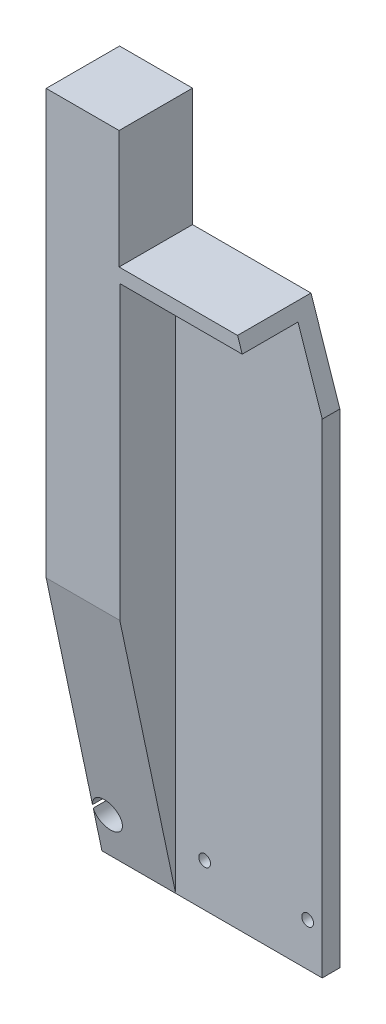
ISO-10303-21;
HEADER;
FILE_DESCRIPTION(('STEP AP214'),'2;1');
FILE_NAME('part.step','',(''),(''),'','','');
FILE_SCHEMA(('AUTOMOTIVE_DESIGN { 1 0 10303 214 1 1 1 1 }'));
ENDSEC;
DATA;
#1=APPLICATION_CONTEXT('core data for automotive mechanical design processes');
#2=APPLICATION_PROTOCOL_DEFINITION('international standard','automotive_design',2000,#1);
#3=PRODUCT_CONTEXT('',#1,'mechanical');
#4=PRODUCT('Part','Part','',(#3));
#5=PRODUCT_RELATED_PRODUCT_CATEGORY('part','',(#4));
#6=PRODUCT_DEFINITION_FORMATION('','',#4);
#7=PRODUCT_DEFINITION_CONTEXT('part definition',#1,'design');
#8=PRODUCT_DEFINITION('design','',#6,#7);
#9=PRODUCT_DEFINITION_SHAPE('','',#8);
#10=(LENGTH_UNIT() NAMED_UNIT(*) SI_UNIT(.MILLI.,.METRE.));
#11=(NAMED_UNIT(*) PLANE_ANGLE_UNIT() SI_UNIT($,.RADIAN.));
#12=(NAMED_UNIT(*) SI_UNIT($,.STERADIAN.) SOLID_ANGLE_UNIT());
#13=UNCERTAINTY_MEASURE_WITH_UNIT(LENGTH_MEASURE(1.E-05),#10,'distance_accuracy_value','');
#14=(GEOMETRIC_REPRESENTATION_CONTEXT(3) GLOBAL_UNCERTAINTY_ASSIGNED_CONTEXT((#13)) GLOBAL_UNIT_ASSIGNED_CONTEXT((#10,
#11,#12)) REPRESENTATION_CONTEXT('',''));
#15=CARTESIAN_POINT('',(0.,0.,0.));
#16=DIRECTION('',(0.,0.,1.));
#17=DIRECTION('',(1.,0.,0.));
#18=AXIS2_PLACEMENT_3D('',#15,#16,#17);
#19=CARTESIAN_POINT('',(0.,0.,6.));
#20=DIRECTION('',(0.,0.,1.));
#21=DIRECTION('',(1.,0.,0.));
#22=AXIS2_PLACEMENT_3D('',#19,#20,#21);
#23=PLANE('',#22);
#24=CARTESIAN_POINT('',(-2.54199999999999,-102.503947691992,6.));
#25=DIRECTION('',(0.,0.,1.));
#26=DIRECTION('',(1.,0.,0.));
#27=AXIS2_PLACEMENT_3D('',#24,#25,#26);
#28=CIRCLE('',#27,2.);
#29=CARTESIAN_POINT('',(-0.541999999999991,-102.503947691992,6.));
#30=VERTEX_POINT('',#29);
#31=EDGE_CURVE('E162',#30,#30,#28,.T.);
#32=ORIENTED_EDGE('',*,*,#31,.F.);
#33=EDGE_LOOP('',(#32));
#34=FACE_BOUND('',#33,.T.);
#35=CARTESIAN_POINT('',(32.532413900171,-102.503947691992,6.));
#36=DIRECTION('',(0.,0.,1.));
#37=DIRECTION('',(1.,0.,0.));
#38=AXIS2_PLACEMENT_3D('',#35,#36,#37);
#39=CIRCLE('',#38,2.);
#40=CARTESIAN_POINT('',(34.532413900171,-102.503947691992,6.));
#41=VERTEX_POINT('',#40);
#42=EDGE_CURVE('E165',#41,#41,#39,.T.);
#43=ORIENTED_EDGE('',*,*,#42,.F.);
#44=EDGE_LOOP('',(#43));
#45=FACE_BOUND('',#44,.T.);
#46=DIRECTION('',(-1.,0.,0.));
#47=VECTOR('',#46,1.);
#48=CARTESIAN_POINT('',(0.,72.1629607492441,6.));
#49=LINE('',#48,#47);
#50=CARTESIAN_POINT('',(29.262581995732,72.1629607492441,6.));
#51=VERTEX_POINT('',#50);
#52=CARTESIAN_POINT('',(-12.416,72.1629607492441,6.));
#53=VERTEX_POINT('',#52);
#54=EDGE_CURVE('E59',#51,#53,#49,.T.);
#55=ORIENTED_EDGE('',*,*,#54,.T.);
#56=DIRECTION('',(0.,-1.,0.));
#57=VECTOR('',#56,1.);
#58=CARTESIAN_POINT('',(-12.416,0.,6.));
#59=LINE('',#58,#57);
#60=CARTESIAN_POINT('',(-12.416,-117.1625,6.));
#61=VERTEX_POINT('',#60);
#62=EDGE_CURVE('E139',#53,#61,#59,.T.);
#63=ORIENTED_EDGE('',*,*,#62,.T.);
#64=DIRECTION('',(1.,0.,0.));
#65=VECTOR('',#64,1.);
#66=CARTESIAN_POINT('',(0.,-117.1625,6.));
#67=LINE('',#66,#65);
#68=CARTESIAN_POINT('',(37.5,-117.1625,6.));
#69=VERTEX_POINT('',#68);
#70=EDGE_CURVE('E143',#61,#69,#67,.T.);
#71=ORIENTED_EDGE('',*,*,#70,.T.);
#72=DIRECTION('',(0.,1.,0.));
#73=VECTOR('',#72,1.);
#74=CARTESIAN_POINT('',(37.5,0.,6.));
#75=LINE('',#74,#73);
#76=CARTESIAN_POINT('',(37.5,47.6317639070895,6.));
#77=VERTEX_POINT('',#76);
#78=EDGE_CURVE('E151',#69,#77,#75,.T.);
#79=ORIENTED_EDGE('',*,*,#78,.T.);
#80=DIRECTION('',(-0.318326018938917,0.947981300272585,0.));
#81=VECTOR('',#80,1.);
#82=CARTESIAN_POINT('',(48.0737703602293,16.1428626595854,6.));
#83=LINE('',#82,#81);
#84=EDGE_CURVE('E154',#77,#51,#83,.T.);
#85=ORIENTED_EDGE('',*,*,#84,.T.);
#86=EDGE_LOOP('',(#55,#63,#71,#79,#85));
#87=FACE_BOUND('',#86,.T.);
#88=ADVANCED_FACE('F37',(#34,#45,#87),#23,.T.);
#89=CARTESIAN_POINT('',(-37.5,0.,6.));
#90=DIRECTION('',(1.,0.,0.));
#91=DIRECTION('',(0.,0.,-1.));
#92=AXIS2_PLACEMENT_3D('',#89,#90,#91);
#93=PLANE('',#92);
#94=DIRECTION('',(0.,0.,-1.));
#95=VECTOR('',#94,1.);
#96=CARTESIAN_POINT('',(-37.5,-101.931361021652,6.));
#97=LINE('',#96,#95);
#98=CARTESIAN_POINT('',(-37.5,-101.931361021652,9.2154626732068));
#99=VERTEX_POINT('',#98);
#100=CARTESIAN_POINT('',(-37.5,-101.931361021652,0.));
#101=VERTEX_POINT('',#100);
#102=EDGE_CURVE('E45',#99,#101,#97,.T.);
#103=ORIENTED_EDGE('',*,*,#102,.F.);
#104=DIRECTION('',(0.,0.978434284203546,0.206558348887415));
#105=VECTOR('',#104,1.);
#106=CARTESIAN_POINT('',(-37.5,-4.99889640704409,29.6789829807351));
#107=LINE('',#106,#105);
#108=CARTESIAN_POINT('',(-37.5,-27.1625,25.));
#109=VERTEX_POINT('',#108);
#110=EDGE_CURVE('E230',#99,#109,#107,.T.);
#111=ORIENTED_EDGE('',*,*,#110,.T.);
#112=DIRECTION('',(0.,-1.,0.));
#113=VECTOR('',#112,1.);
#114=CARTESIAN_POINT('',(-37.5,0.,25.));
#115=LINE('',#114,#113);
#116=CARTESIAN_POINT('',(-37.5,117.1625,25.));
#117=VERTEX_POINT('',#116);
#118=EDGE_CURVE('E234',#117,#109,#115,.T.);
#119=ORIENTED_EDGE('',*,*,#118,.F.);
#120=DIRECTION('',(0.,0.,-1.));
#121=VECTOR('',#120,1.);
#122=CARTESIAN_POINT('',(-37.5,117.1625,6.));
#123=LINE('',#122,#121);
#124=CARTESIAN_POINT('',(-37.5,117.1625,0.));
#125=VERTEX_POINT('',#124);
#126=EDGE_CURVE('E168',#117,#125,#123,.T.);
#127=ORIENTED_EDGE('',*,*,#126,.T.);
#128=DIRECTION('',(0.,-1.,0.));
#129=VECTOR('',#128,1.);
#130=CARTESIAN_POINT('',(-37.5,0.,0.));
#131=LINE('',#130,#129);
#132=EDGE_CURVE('E145',#125,#101,#131,.T.);
#133=ORIENTED_EDGE('',*,*,#132,.T.);
#134=EDGE_LOOP('',(#103,#111,#119,#127,#133));
#135=FACE_BOUND('',#134,.T.);
#136=ADVANCED_FACE('F39',(#135),#93,.F.);
#137=CARTESIAN_POINT('',(-32.532413900171,-102.499769625378,6.));
#138=DIRECTION('',(0.,0.,-1.));
#139=DIRECTION('',(-1.,0.,0.));
#140=AXIS2_PLACEMENT_3D('',#137,#138,#139);
#141=CYLINDRICAL_SURFACE('',#140,5.00000000000038);
#142=CARTESIAN_POINT('',(-32.532413900171,-102.499769625378,9.09546530130909));
#143=DIRECTION('',(0.,0.206558348887415,-0.978434284203546));
#144=DIRECTION('',(0.,-0.978434284203546,-0.206558348887415));
#145=AXIS2_PLACEMENT_3D('',#142,#143,#144);
#146=ELLIPSE('',#145,5.11020523373261,5.00000000000038);
#147=CARTESIAN_POINT('',(-37.5,-103.068178229104,8.97546792941138));
#148=VERTEX_POINT('',#147);
#149=EDGE_CURVE('E215',#99,#148,#146,.T.);
#150=ORIENTED_EDGE('',*,*,#149,.F.);
#151=ORIENTED_EDGE('',*,*,#102,.T.);
#152=CARTESIAN_POINT('',(-32.532413900171,-102.499769625378,0.));
#153=DIRECTION('',(0.,0.,1.));
#154=DIRECTION('',(1.,0.,0.));
#155=AXIS2_PLACEMENT_3D('',#152,#153,#154);
#156=CIRCLE('',#155,5.00000000000038);
#157=CARTESIAN_POINT('',(-37.5,-103.068178229104,0.));
#158=VERTEX_POINT('',#157);
#159=EDGE_CURVE('E171',#158,#101,#156,.T.);
#160=ORIENTED_EDGE('',*,*,#159,.F.);
#161=DIRECTION('',(0.,0.,-1.));
#162=VECTOR('',#161,1.);
#163=CARTESIAN_POINT('',(-37.5,-103.068178229104,6.));
#164=LINE('',#163,#162);
#165=EDGE_CURVE('E208',#148,#158,#164,.T.);
#166=ORIENTED_EDGE('',*,*,#165,.F.);
#167=EDGE_LOOP('',(#150,#151,#160,#166));
#168=FACE_BOUND('',#167,.T.);
#169=ADVANCED_FACE('F213',(#168),#141,.F.);
#170=CARTESIAN_POINT('',(-37.5,0.,6.));
#171=DIRECTION('',(1.,0.,0.));
#172=DIRECTION('',(0.,0.,-1.));
#173=AXIS2_PLACEMENT_3D('',#170,#171,#172);
#174=PLANE('',#173);
#175=DIRECTION('',(0.,0.,-1.));
#176=VECTOR('',#175,1.);
#177=CARTESIAN_POINT('',(-37.5,-117.1625,6.));
#178=LINE('',#177,#176);
#179=CARTESIAN_POINT('',(-37.5,-117.1625,6.));
#180=VERTEX_POINT('',#179);
#181=CARTESIAN_POINT('',(-37.5,-117.1625,0.));
#182=VERTEX_POINT('',#181);
#183=EDGE_CURVE('E206',#180,#182,#178,.T.);
#184=ORIENTED_EDGE('',*,*,#183,.F.);
#185=DIRECTION('',(0.,0.978434284203546,0.206558348887415));
#186=VECTOR('',#185,1.);
#187=CARTESIAN_POINT('',(-37.5,-4.99889640704409,29.6789829807351));
#188=LINE('',#187,#186);
#189=EDGE_CURVE('E130',#180,#148,#188,.T.);
#190=ORIENTED_EDGE('',*,*,#189,.T.);
#191=ORIENTED_EDGE('',*,*,#165,.T.);
#192=DIRECTION('',(0.,-1.,0.));
#193=VECTOR('',#192,1.);
#194=CARTESIAN_POINT('',(-37.5,0.,0.));
#195=LINE('',#194,#193);
#196=EDGE_CURVE('E174',#158,#182,#195,.T.);
#197=ORIENTED_EDGE('',*,*,#196,.T.);
#198=EDGE_LOOP('',(#184,#190,#191,#197));
#199=FACE_BOUND('',#198,.T.);
#200=ADVANCED_FACE('F228',(#199),#174,.F.);
#201=CARTESIAN_POINT('',(0.,-117.1625,6.));
#202=DIRECTION('',(0.,1.,0.));
#203=DIRECTION('',(0.,0.,1.));
#204=AXIS2_PLACEMENT_3D('',#201,#202,#203);
#205=PLANE('',#204);
#206=ORIENTED_EDGE('',*,*,#70,.F.);
#207=DIRECTION('',(1.,0.,0.));
#208=VECTOR('',#207,1.);
#209=CARTESIAN_POINT('',(-38.416,-117.1625,6.));
#210=LINE('',#209,#208);
#211=EDGE_CURVE('E127',#180,#61,#210,.T.);
#212=ORIENTED_EDGE('',*,*,#211,.F.);
#213=ORIENTED_EDGE('',*,*,#183,.T.);
#214=DIRECTION('',(1.,0.,0.));
#215=VECTOR('',#214,1.);
#216=CARTESIAN_POINT('',(0.,-117.1625,0.));
#217=LINE('',#216,#215);
#218=CARTESIAN_POINT('',(37.5,-117.1625,0.));
#219=VERTEX_POINT('',#218);
#220=EDGE_CURVE('E177',#182,#219,#217,.T.);
#221=ORIENTED_EDGE('',*,*,#220,.T.);
#222=DIRECTION('',(0.,0.,-1.));
#223=VECTOR('',#222,1.);
#224=CARTESIAN_POINT('',(37.5,-117.1625,6.));
#225=LINE('',#224,#223);
#226=EDGE_CURVE('E149',#69,#219,#225,.T.);
#227=ORIENTED_EDGE('',*,*,#226,.F.);
#228=EDGE_LOOP('',(#206,#212,#213,#221,#227));
#229=FACE_BOUND('',#228,.T.);
#230=ADVANCED_FACE('F147',(#229),#205,.F.);
#231=CARTESIAN_POINT('',(37.5,0.,6.));
#232=DIRECTION('',(-1.,0.,0.));
#233=DIRECTION('',(0.,0.,1.));
#234=AXIS2_PLACEMENT_3D('',#231,#232,#233);
#235=PLANE('',#234);
#236=DIRECTION('',(0.,1.,0.));
#237=VECTOR('',#236,1.);
#238=CARTESIAN_POINT('',(37.5,0.,0.));
#239=LINE('',#238,#237);
#240=CARTESIAN_POINT('',(37.5,47.6317639070895,0.));
#241=VERTEX_POINT('',#240);
#242=EDGE_CURVE('E179',#219,#241,#239,.T.);
#243=ORIENTED_EDGE('',*,*,#242,.T.);
#244=DIRECTION('',(0.,0.,-1.));
#245=VECTOR('',#244,1.);
#246=CARTESIAN_POINT('',(37.5,47.6317639070895,6.));
#247=LINE('',#246,#245);
#248=EDGE_CURVE('E202',#77,#241,#247,.T.);
#249=ORIENTED_EDGE('',*,*,#248,.F.);
#250=ORIENTED_EDGE('',*,*,#78,.F.);
#251=ORIENTED_EDGE('',*,*,#226,.T.);
#252=EDGE_LOOP('',(#243,#249,#250,#251));
#253=FACE_BOUND('',#252,.T.);
#254=ADVANCED_FACE('F280',(#253),#235,.F.);
#255=CARTESIAN_POINT('',(48.0737703602293,16.1428626595854,6.));
#256=DIRECTION('',(-0.947981300272585,-0.318326018938917,0.));
#257=DIRECTION('',(0.318326018938917,-0.947981300272585,0.));
#258=AXIS2_PLACEMENT_3D('',#255,#256,#257);
#259=PLANE('',#258);
#260=DIRECTION('',(0.,0.,-1.));
#261=VECTOR('',#260,1.);
#262=CARTESIAN_POINT('',(27.667562569162,76.9129607492441,6.));
#263=LINE('',#262,#261);
#264=CARTESIAN_POINT('',(27.667562569162,76.9129607492441,25.));
#265=VERTEX_POINT('',#264);
#266=CARTESIAN_POINT('',(27.667562569162,76.9129607492441,0.));
#267=VERTEX_POINT('',#266);
#268=EDGE_CURVE('E199',#265,#267,#263,.T.);
#269=ORIENTED_EDGE('',*,*,#268,.F.);
#270=DIRECTION('',(-0.318326018938917,0.947981300272585,0.));
#271=VECTOR('',#270,1.);
#272=CARTESIAN_POINT('',(48.0737703602293,16.1428626595854,25.));
#273=LINE('',#272,#271);
#274=CARTESIAN_POINT('',(29.262581995732,72.1629607492441,25.));
#275=VERTEX_POINT('',#274);
#276=EDGE_CURVE('E240',#275,#265,#273,.T.);
#277=ORIENTED_EDGE('',*,*,#276,.F.);
#278=DIRECTION('',(0.,0.,-1.));
#279=VECTOR('',#278,1.);
#280=CARTESIAN_POINT('',(29.262581995732,72.1629607492441,25.));
#281=LINE('',#280,#279);
#282=EDGE_CURVE('E252',#275,#51,#281,.T.);
#283=ORIENTED_EDGE('',*,*,#282,.T.);
#284=ORIENTED_EDGE('',*,*,#84,.F.);
#285=ORIENTED_EDGE('',*,*,#248,.T.);
#286=DIRECTION('',(-0.318326018938917,0.947981300272585,0.));
#287=VECTOR('',#286,1.);
#288=CARTESIAN_POINT('',(48.0737703602293,16.1428626595854,0.));
#289=LINE('',#288,#287);
#290=EDGE_CURVE('E181',#241,#267,#289,.T.);
#291=ORIENTED_EDGE('',*,*,#290,.T.);
#292=EDGE_LOOP('',(#269,#277,#283,#284,#285,#291));
#293=FACE_BOUND('',#292,.T.);
#294=ADVANCED_FACE('F276',(#293),#259,.F.);
#295=CARTESIAN_POINT('',(0.,76.9129607492441,6.));
#296=DIRECTION('',(0.,-1.,0.));
#297=DIRECTION('',(1.,0.,0.));
#298=AXIS2_PLACEMENT_3D('',#295,#296,#297);
#299=PLANE('',#298);
#300=DIRECTION('',(-1.,0.,0.));
#301=VECTOR('',#300,1.);
#302=CARTESIAN_POINT('',(0.,76.9129607492441,0.));
#303=LINE('',#302,#301);
#304=CARTESIAN_POINT('',(-12.666,76.9129607492441,0.));
#305=VERTEX_POINT('',#304);
#306=EDGE_CURVE('E183',#267,#305,#303,.T.);
#307=ORIENTED_EDGE('',*,*,#306,.T.);
#308=DIRECTION('',(0.,0.,-1.));
#309=VECTOR('',#308,1.);
#310=CARTESIAN_POINT('',(-12.666,76.9129607492441,6.));
#311=LINE('',#310,#309);
#312=CARTESIAN_POINT('',(-12.666,76.9129607492441,25.));
#313=VERTEX_POINT('',#312);
#314=EDGE_CURVE('E196',#313,#305,#311,.T.);
#315=ORIENTED_EDGE('',*,*,#314,.F.);
#316=DIRECTION('',(-1.,0.,0.));
#317=VECTOR('',#316,1.);
#318=CARTESIAN_POINT('',(0.,76.9129607492441,25.));
#319=LINE('',#318,#317);
#320=EDGE_CURVE('E243',#265,#313,#319,.T.);
#321=ORIENTED_EDGE('',*,*,#320,.F.);
#322=ORIENTED_EDGE('',*,*,#268,.T.);
#323=EDGE_LOOP('',(#307,#315,#321,#322));
#324=FACE_BOUND('',#323,.T.);
#325=ADVANCED_FACE('F274',(#324),#299,.F.);
#326=CARTESIAN_POINT('',(-12.666,0.,6.));
#327=DIRECTION('',(-1.,0.,0.));
#328=DIRECTION('',(0.,0.,1.));
#329=AXIS2_PLACEMENT_3D('',#326,#327,#328);
#330=PLANE('',#329);
#331=DIRECTION('',(0.,1.,0.));
#332=VECTOR('',#331,1.);
#333=CARTESIAN_POINT('',(-12.666,0.,0.));
#334=LINE('',#333,#332);
#335=CARTESIAN_POINT('',(-12.666,117.1625,0.));
#336=VERTEX_POINT('',#335);
#337=EDGE_CURVE('E185',#305,#336,#334,.T.);
#338=ORIENTED_EDGE('',*,*,#337,.T.);
#339=DIRECTION('',(0.,0.,-1.));
#340=VECTOR('',#339,1.);
#341=CARTESIAN_POINT('',(-12.666,117.1625,6.));
#342=LINE('',#341,#340);
#343=CARTESIAN_POINT('',(-12.666,117.1625,25.));
#344=VERTEX_POINT('',#343);
#345=EDGE_CURVE('E193',#344,#336,#342,.T.);
#346=ORIENTED_EDGE('',*,*,#345,.F.);
#347=DIRECTION('',(0.,1.,0.));
#348=VECTOR('',#347,1.);
#349=CARTESIAN_POINT('',(-12.666,0.,25.));
#350=LINE('',#349,#348);
#351=EDGE_CURVE('E246',#313,#344,#350,.T.);
#352=ORIENTED_EDGE('',*,*,#351,.F.);
#353=ORIENTED_EDGE('',*,*,#314,.T.);
#354=EDGE_LOOP('',(#338,#346,#352,#353));
#355=FACE_BOUND('',#354,.T.);
#356=ADVANCED_FACE('F272',(#355),#330,.F.);
#357=CARTESIAN_POINT('',(-2.54199999999999,-102.503947691992,6.));
#358=DIRECTION('',(0.,0.,-1.));
#359=DIRECTION('',(-1.,0.,0.));
#360=AXIS2_PLACEMENT_3D('',#357,#358,#359);
#361=CYLINDRICAL_SURFACE('',#360,2.);
#362=ORIENTED_EDGE('',*,*,#31,.T.);
#363=EDGE_LOOP('',(#362));
#364=FACE_BOUND('',#363,.T.);
#365=CARTESIAN_POINT('',(-2.54199999999999,-102.503947691992,0.));
#366=DIRECTION('',(0.,0.,1.));
#367=DIRECTION('',(1.,0.,0.));
#368=AXIS2_PLACEMENT_3D('',#365,#366,#367);
#369=CIRCLE('',#368,2.);
#370=CARTESIAN_POINT('',(-0.541999999999991,-102.503947691992,0.));
#371=VERTEX_POINT('',#370);
#372=EDGE_CURVE('E157',#371,#371,#369,.T.);
#373=ORIENTED_EDGE('',*,*,#372,.F.);
#374=EDGE_LOOP('',(#373));
#375=FACE_BOUND('',#374,.T.);
#376=ADVANCED_FACE('F306',(#364,#375),#361,.F.);
#377=CARTESIAN_POINT('',(0.,117.1625,6.));
#378=DIRECTION('',(0.,-1.,0.));
#379=DIRECTION('',(0.,0.,-1.));
#380=AXIS2_PLACEMENT_3D('',#377,#378,#379);
#381=PLANE('',#380);
#382=DIRECTION('',(-1.,0.,0.));
#383=VECTOR('',#382,1.);
#384=CARTESIAN_POINT('',(0.,117.1625,0.));
#385=LINE('',#384,#383);
#386=EDGE_CURVE('E187',#336,#125,#385,.T.);
#387=ORIENTED_EDGE('',*,*,#386,.T.);
#388=ORIENTED_EDGE('',*,*,#126,.F.);
#389=DIRECTION('',(-1.,0.,0.));
#390=VECTOR('',#389,1.);
#391=CARTESIAN_POINT('',(0.,117.1625,25.));
#392=LINE('',#391,#390);
#393=EDGE_CURVE('E249',#344,#117,#392,.T.);
#394=ORIENTED_EDGE('',*,*,#393,.F.);
#395=ORIENTED_EDGE('',*,*,#345,.T.);
#396=EDGE_LOOP('',(#387,#388,#394,#395));
#397=FACE_BOUND('',#396,.T.);
#398=ADVANCED_FACE('F267',(#397),#381,.F.);
#399=CARTESIAN_POINT('',(32.532413900171,-102.503947691992,6.));
#400=DIRECTION('',(0.,0.,-1.));
#401=DIRECTION('',(-1.,0.,0.));
#402=AXIS2_PLACEMENT_3D('',#399,#400,#401);
#403=CYLINDRICAL_SURFACE('',#402,2.);
#404=ORIENTED_EDGE('',*,*,#42,.T.);
#405=EDGE_LOOP('',(#404));
#406=FACE_BOUND('',#405,.T.);
#407=CARTESIAN_POINT('',(32.532413900171,-102.503947691992,0.));
#408=DIRECTION('',(0.,0.,1.));
#409=DIRECTION('',(1.,0.,0.));
#410=AXIS2_PLACEMENT_3D('',#407,#408,#409);
#411=CIRCLE('',#410,2.);
#412=CARTESIAN_POINT('',(34.532413900171,-102.503947691992,0.));
#413=VERTEX_POINT('',#412);
#414=EDGE_CURVE('E152',#413,#413,#411,.T.);
#415=ORIENTED_EDGE('',*,*,#414,.F.);
#416=EDGE_LOOP('',(#415));
#417=FACE_BOUND('',#416,.T.);
#418=ADVANCED_FACE('F302',(#406,#417),#403,.F.);
#419=CARTESIAN_POINT('',(0.,0.,0.));
#420=DIRECTION('',(0.,0.,1.));
#421=DIRECTION('',(1.,0.,0.));
#422=AXIS2_PLACEMENT_3D('',#419,#420,#421);
#423=PLANE('',#422);
#424=ORIENTED_EDGE('',*,*,#242,.F.);
#425=ORIENTED_EDGE('',*,*,#220,.F.);
#426=ORIENTED_EDGE('',*,*,#196,.F.);
#427=ORIENTED_EDGE('',*,*,#159,.T.);
#428=ORIENTED_EDGE('',*,*,#132,.F.);
#429=ORIENTED_EDGE('',*,*,#386,.F.);
#430=ORIENTED_EDGE('',*,*,#337,.F.);
#431=ORIENTED_EDGE('',*,*,#306,.F.);
#432=ORIENTED_EDGE('',*,*,#290,.F.);
#433=EDGE_LOOP('',(#424,#425,#426,#427,#428,#429,#430,#431,#432));
#434=FACE_BOUND('',#433,.T.);
#435=ORIENTED_EDGE('',*,*,#414,.T.);
#436=EDGE_LOOP('',(#435));
#437=FACE_BOUND('',#436,.T.);
#438=ORIENTED_EDGE('',*,*,#372,.T.);
#439=EDGE_LOOP('',(#438));
#440=FACE_BOUND('',#439,.T.);
#441=ADVANCED_FACE('F224',(#434,#437,#440),#423,.F.);
#442=CARTESIAN_POINT('',(-12.416,0.,25.));
#443=DIRECTION('',(-1.,0.,0.));
#444=DIRECTION('',(0.,0.,1.));
#445=AXIS2_PLACEMENT_3D('',#442,#443,#444);
#446=PLANE('',#445);
#447=DIRECTION('',(0.,1.,0.));
#448=VECTOR('',#447,1.);
#449=CARTESIAN_POINT('',(-12.416,0.,25.));
#450=LINE('',#449,#448);
#451=CARTESIAN_POINT('',(-12.416,-27.1625,25.));
#452=VERTEX_POINT('',#451);
#453=CARTESIAN_POINT('',(-12.416,72.1629607492441,25.));
#454=VERTEX_POINT('',#453);
#455=EDGE_CURVE('E141',#452,#454,#450,.T.);
#456=ORIENTED_EDGE('',*,*,#455,.F.);
#457=DIRECTION('',(0.,0.978434284203546,0.206558348887415));
#458=VECTOR('',#457,1.);
#459=CARTESIAN_POINT('',(-12.416,-27.1625,25.));
#460=LINE('',#459,#458);
#461=EDGE_CURVE('E51',#61,#452,#460,.T.);
#462=ORIENTED_EDGE('',*,*,#461,.F.);
#463=ORIENTED_EDGE('',*,*,#62,.F.);
#464=DIRECTION('',(0.,0.,-1.));
#465=VECTOR('',#464,1.);
#466=CARTESIAN_POINT('',(-12.416,72.1629607492441,25.));
#467=LINE('',#466,#465);
#468=EDGE_CURVE('E255',#454,#53,#467,.T.);
#469=ORIENTED_EDGE('',*,*,#468,.F.);
#470=EDGE_LOOP('',(#456,#462,#463,#469));
#471=FACE_BOUND('',#470,.T.);
#472=ADVANCED_FACE('F137',(#471),#446,.F.);
#473=CARTESIAN_POINT('',(0.,72.1629607492441,25.));
#474=DIRECTION('',(0.,1.,0.));
#475=DIRECTION('',(0.,0.,1.));
#476=AXIS2_PLACEMENT_3D('',#473,#474,#475);
#477=PLANE('',#476);
#478=ORIENTED_EDGE('',*,*,#54,.F.);
#479=ORIENTED_EDGE('',*,*,#282,.F.);
#480=DIRECTION('',(1.,0.,0.));
#481=VECTOR('',#480,1.);
#482=CARTESIAN_POINT('',(0.,72.1629607492441,25.));
#483=LINE('',#482,#481);
#484=EDGE_CURVE('E238',#454,#275,#483,.T.);
#485=ORIENTED_EDGE('',*,*,#484,.F.);
#486=ORIENTED_EDGE('',*,*,#468,.T.);
#487=EDGE_LOOP('',(#478,#479,#485,#486));
#488=FACE_BOUND('',#487,.T.);
#489=ADVANCED_FACE('F258',(#488),#477,.F.);
#490=CARTESIAN_POINT('',(0.,0.,25.));
#491=DIRECTION('',(0.,0.,1.));
#492=DIRECTION('',(1.,0.,0.));
#493=AXIS2_PLACEMENT_3D('',#490,#491,#492);
#494=PLANE('',#493);
#495=DIRECTION('',(-1.,0.,0.));
#496=VECTOR('',#495,1.);
#497=CARTESIAN_POINT('',(0.,-27.1625,25.));
#498=LINE('',#497,#496);
#499=EDGE_CURVE('E11',#452,#109,#498,.T.);
#500=ORIENTED_EDGE('',*,*,#499,.F.);
#501=ORIENTED_EDGE('',*,*,#455,.T.);
#502=ORIENTED_EDGE('',*,*,#484,.T.);
#503=ORIENTED_EDGE('',*,*,#276,.T.);
#504=ORIENTED_EDGE('',*,*,#320,.T.);
#505=ORIENTED_EDGE('',*,*,#351,.T.);
#506=ORIENTED_EDGE('',*,*,#393,.T.);
#507=ORIENTED_EDGE('',*,*,#118,.T.);
#508=EDGE_LOOP('',(#500,#501,#502,#503,#504,#505,#506,#507));
#509=FACE_BOUND('',#508,.T.);
#510=ADVANCED_FACE('F262',(#509),#494,.T.);
#511=CARTESIAN_POINT('',(-38.416,-27.1625,25.));
#512=DIRECTION('',(0.,0.206558348887415,-0.978434284203546));
#513=DIRECTION('',(0.,0.978434284203546,0.206558348887415));
#514=AXIS2_PLACEMENT_3D('',#511,#512,#513);
#515=PLANE('',#514);
#516=ORIENTED_EDGE('',*,*,#149,.T.);
#517=ORIENTED_EDGE('',*,*,#189,.F.);
#518=ORIENTED_EDGE('',*,*,#211,.T.);
#519=ORIENTED_EDGE('',*,*,#461,.T.);
#520=ORIENTED_EDGE('',*,*,#499,.T.);
#521=ORIENTED_EDGE('',*,*,#110,.F.);
#522=EDGE_LOOP('',(#516,#517,#518,#519,#520,#521));
#523=FACE_BOUND('',#522,.T.);
#524=ADVANCED_FACE('F128',(#523),#515,.F.);
#525=CLOSED_SHELL('',(#88,#136,#169,#200,#230,#254,#294,#325,#356,#376,#398,#418,#441,#472,#489,
#510,#524));
#526=MANIFOLD_SOLID_BREP('B2',#525);
#527=ADVANCED_BREP_SHAPE_REPRESENTATION('',(#18,#526),#14);
#528=SHAPE_DEFINITION_REPRESENTATION(#9,#527);
ENDSEC;
END-ISO-10303-21;
